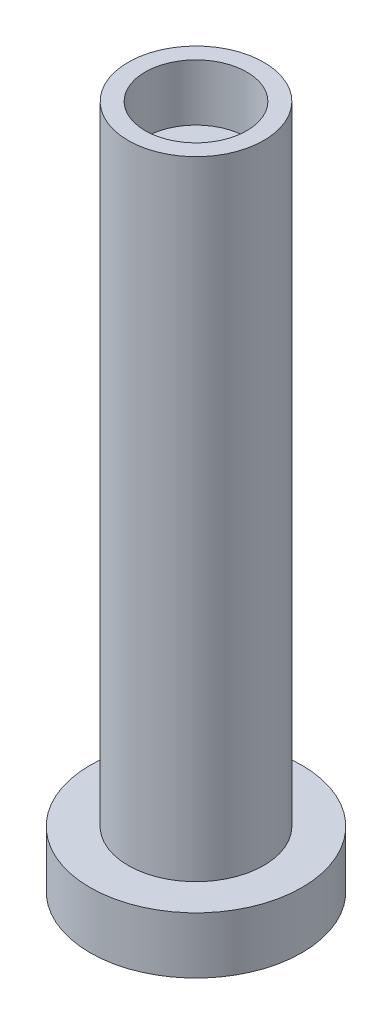
ISO-10303-21;
HEADER;
FILE_DESCRIPTION(('STEP AP214'),'2;1');
FILE_NAME('part.step','',(''),(''),'','','');
FILE_SCHEMA(('AUTOMOTIVE_DESIGN { 1 0 10303 214 1 1 1 1 }'));
ENDSEC;
DATA;
#1=APPLICATION_CONTEXT('core data for automotive mechanical design processes');
#2=APPLICATION_PROTOCOL_DEFINITION('international standard','automotive_design',2000,#1);
#3=PRODUCT_CONTEXT('',#1,'mechanical');
#4=PRODUCT('Part','Part','',(#3));
#5=PRODUCT_RELATED_PRODUCT_CATEGORY('part','',(#4));
#6=PRODUCT_DEFINITION_FORMATION('','',#4);
#7=PRODUCT_DEFINITION_CONTEXT('part definition',#1,'design');
#8=PRODUCT_DEFINITION('design','',#6,#7);
#9=PRODUCT_DEFINITION_SHAPE('','',#8);
#10=(LENGTH_UNIT() NAMED_UNIT(*) SI_UNIT(.MILLI.,.METRE.));
#11=(NAMED_UNIT(*) PLANE_ANGLE_UNIT() SI_UNIT($,.RADIAN.));
#12=(NAMED_UNIT(*) SI_UNIT($,.STERADIAN.) SOLID_ANGLE_UNIT());
#13=UNCERTAINTY_MEASURE_WITH_UNIT(LENGTH_MEASURE(1.E-05),#10,'distance_accuracy_value','');
#14=(GEOMETRIC_REPRESENTATION_CONTEXT(3) GLOBAL_UNCERTAINTY_ASSIGNED_CONTEXT((#13)) GLOBAL_UNIT_ASSIGNED_CONTEXT((#10,
#11,#12)) REPRESENTATION_CONTEXT('',''));
#15=CARTESIAN_POINT('',(0.,0.,0.));
#16=DIRECTION('',(0.,0.,1.));
#17=DIRECTION('',(1.,0.,0.));
#18=AXIS2_PLACEMENT_3D('',#15,#16,#17);
#19=CARTESIAN_POINT('',(0.,44.45,0.));
#20=DIRECTION('',(0.,-1.,0.));
#21=DIRECTION('',(0.,0.,-1.));
#22=AXIS2_PLACEMENT_3D('',#19,#20,#21);
#23=CYLINDRICAL_SURFACE('',#22,4.8);
#24=CARTESIAN_POINT('',(0.,44.45,0.));
#25=DIRECTION('',(0.,1.,0.));
#26=DIRECTION('',(0.,0.,1.));
#27=AXIS2_PLACEMENT_3D('',#24,#25,#26);
#28=CIRCLE('',#27,4.8);
#29=CARTESIAN_POINT('',(0.,44.45,4.8));
#30=VERTEX_POINT('',#29);
#31=EDGE_CURVE('E10',#30,#30,#28,.T.);
#32=ORIENTED_EDGE('',*,*,#31,.F.);
#33=EDGE_LOOP('',(#32));
#34=FACE_BOUND('',#33,.T.);
#35=CARTESIAN_POINT('',(0.,0.,0.));
#36=DIRECTION('',(0.,1.,0.));
#37=DIRECTION('',(0.,0.,1.));
#38=AXIS2_PLACEMENT_3D('',#35,#36,#37);
#39=CIRCLE('',#38,4.8);
#40=CARTESIAN_POINT('',(0.,0.,4.8));
#41=VERTEX_POINT('',#40);
#42=EDGE_CURVE('E42',#41,#41,#39,.T.);
#43=ORIENTED_EDGE('',*,*,#42,.T.);
#44=EDGE_LOOP('',(#43));
#45=FACE_BOUND('',#44,.T.);
#46=ADVANCED_FACE('F39',(#34,#45),#23,.T.);
#47=CARTESIAN_POINT('',(0.,44.45,0.));
#48=DIRECTION('',(0.,1.,0.));
#49=DIRECTION('',(0.,0.,1.));
#50=AXIS2_PLACEMENT_3D('',#47,#48,#49);
#51=PLANE('',#50);
#52=CARTESIAN_POINT('',(0.,44.45,0.));
#53=DIRECTION('',(0.,1.,0.));
#54=DIRECTION('',(0.,0.,1.));
#55=AXIS2_PLACEMENT_3D('',#52,#53,#54);
#56=CIRCLE('',#55,3.6);
#57=CARTESIAN_POINT('',(0.,44.45,3.6));
#58=VERTEX_POINT('',#57);
#59=EDGE_CURVE('E57',#58,#58,#56,.T.);
#60=ORIENTED_EDGE('',*,*,#59,.F.);
#61=EDGE_LOOP('',(#60));
#62=FACE_BOUND('',#61,.T.);
#63=ORIENTED_EDGE('',*,*,#31,.T.);
#64=EDGE_LOOP('',(#63));
#65=FACE_BOUND('',#64,.T.);
#66=ADVANCED_FACE('F72',(#62,#65),#51,.T.);
#67=CARTESIAN_POINT('',(0.,-4.,0.));
#68=DIRECTION('',(0.,1.,0.));
#69=DIRECTION('',(0.,0.,1.));
#70=AXIS2_PLACEMENT_3D('',#67,#68,#69);
#71=CYLINDRICAL_SURFACE('',#70,7.5);
#72=CARTESIAN_POINT('',(0.,-4.,0.));
#73=DIRECTION('',(0.,1.,0.));
#74=DIRECTION('',(0.,0.,1.));
#75=AXIS2_PLACEMENT_3D('',#72,#73,#74);
#76=CIRCLE('',#75,7.5);
#77=CARTESIAN_POINT('',(0.,-4.,7.5));
#78=VERTEX_POINT('',#77);
#79=EDGE_CURVE('E49',#78,#78,#76,.T.);
#80=ORIENTED_EDGE('',*,*,#79,.T.);
#81=EDGE_LOOP('',(#80));
#82=FACE_BOUND('',#81,.T.);
#83=CARTESIAN_POINT('',(0.,0.,0.));
#84=DIRECTION('',(0.,1.,0.));
#85=DIRECTION('',(0.,0.,1.));
#86=AXIS2_PLACEMENT_3D('',#83,#84,#85);
#87=CIRCLE('',#86,7.5);
#88=CARTESIAN_POINT('',(0.,0.,7.5));
#89=VERTEX_POINT('',#88);
#90=EDGE_CURVE('E51',#89,#89,#87,.T.);
#91=ORIENTED_EDGE('',*,*,#90,.F.);
#92=EDGE_LOOP('',(#91));
#93=FACE_BOUND('',#92,.T.);
#94=ADVANCED_FACE('F74',(#82,#93),#71,.T.);
#95=CARTESIAN_POINT('',(0.,-4.,0.));
#96=DIRECTION('',(0.,1.,0.));
#97=DIRECTION('',(0.,0.,1.));
#98=AXIS2_PLACEMENT_3D('',#95,#96,#97);
#99=PLANE('',#98);
#100=ORIENTED_EDGE('',*,*,#79,.F.);
#101=EDGE_LOOP('',(#100));
#102=FACE_BOUND('',#101,.T.);
#103=ADVANCED_FACE('F79',(#102),#99,.F.);
#104=CARTESIAN_POINT('',(0.,0.,0.));
#105=DIRECTION('',(0.,1.,0.));
#106=DIRECTION('',(0.,0.,1.));
#107=AXIS2_PLACEMENT_3D('',#104,#105,#106);
#108=PLANE('',#107);
#109=ORIENTED_EDGE('',*,*,#42,.F.);
#110=EDGE_LOOP('',(#109));
#111=FACE_BOUND('',#110,.T.);
#112=ORIENTED_EDGE('',*,*,#90,.T.);
#113=EDGE_LOOP('',(#112));
#114=FACE_BOUND('',#113,.T.);
#115=ADVANCED_FACE('F68',(#111,#114),#108,.T.);
#116=CARTESIAN_POINT('',(0.,40.45,0.));
#117=DIRECTION('',(0.,1.,0.));
#118=DIRECTION('',(0.,0.,1.));
#119=AXIS2_PLACEMENT_3D('',#116,#117,#118);
#120=CYLINDRICAL_SURFACE('',#119,3.6);
#121=CARTESIAN_POINT('',(0.,40.45,0.));
#122=DIRECTION('',(0.,1.,0.));
#123=DIRECTION('',(0.,0.,1.));
#124=AXIS2_PLACEMENT_3D('',#121,#122,#123);
#125=CIRCLE('',#124,3.6);
#126=CARTESIAN_POINT('',(0.,40.45,3.6));
#127=VERTEX_POINT('',#126);
#128=EDGE_CURVE('E54',#127,#127,#125,.T.);
#129=ORIENTED_EDGE('',*,*,#128,.F.);
#130=EDGE_LOOP('',(#129));
#131=FACE_BOUND('',#130,.T.);
#132=ORIENTED_EDGE('',*,*,#59,.T.);
#133=EDGE_LOOP('',(#132));
#134=FACE_BOUND('',#133,.T.);
#135=ADVANCED_FACE('F65',(#131,#134),#120,.F.);
#136=CARTESIAN_POINT('',(0.,40.45,0.));
#137=DIRECTION('',(0.,1.,0.));
#138=DIRECTION('',(0.,0.,1.));
#139=AXIS2_PLACEMENT_3D('',#136,#137,#138);
#140=PLANE('',#139);
#141=ORIENTED_EDGE('',*,*,#128,.T.);
#142=EDGE_LOOP('',(#141));
#143=FACE_BOUND('',#142,.T.);
#144=ADVANCED_FACE('F63',(#143),#140,.T.);
#145=CLOSED_SHELL('',(#46,#66,#94,#103,#115,#135,#144));
#146=MANIFOLD_SOLID_BREP('B2',#145);
#147=ADVANCED_BREP_SHAPE_REPRESENTATION('',(#18,#146),#14);
#148=SHAPE_DEFINITION_REPRESENTATION(#9,#147);
ENDSEC;
END-ISO-10303-21;
